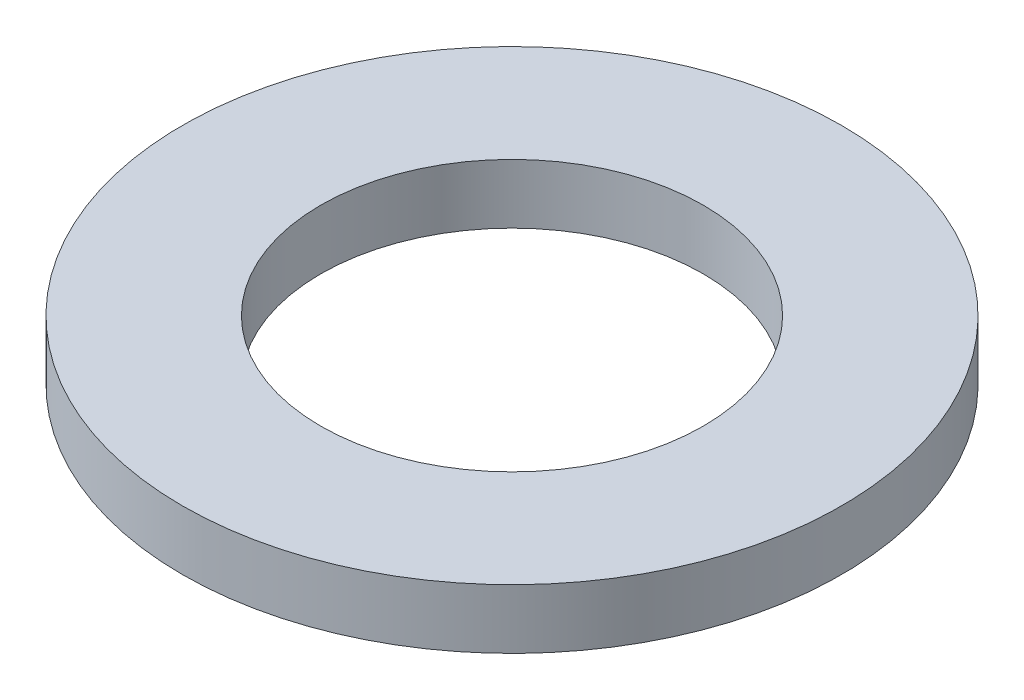
ISO-10303-21;
HEADER;
FILE_DESCRIPTION(('STEP AP214'),'2;1');
FILE_NAME('part.step','',(''),(''),'','','');
FILE_SCHEMA(('AUTOMOTIVE_DESIGN { 1 0 10303 214 1 1 1 1 }'));
ENDSEC;
DATA;
#1=APPLICATION_CONTEXT('core data for automotive mechanical design processes');
#2=APPLICATION_PROTOCOL_DEFINITION('international standard','automotive_design',2000,#1);
#3=PRODUCT_CONTEXT('',#1,'mechanical');
#4=PRODUCT('Part','Part','',(#3));
#5=PRODUCT_RELATED_PRODUCT_CATEGORY('part','',(#4));
#6=PRODUCT_DEFINITION_FORMATION('','',#4);
#7=PRODUCT_DEFINITION_CONTEXT('part definition',#1,'design');
#8=PRODUCT_DEFINITION('design','',#6,#7);
#9=PRODUCT_DEFINITION_SHAPE('','',#8);
#10=(LENGTH_UNIT() NAMED_UNIT(*) SI_UNIT(.MILLI.,.METRE.));
#11=(NAMED_UNIT(*) PLANE_ANGLE_UNIT() SI_UNIT($,.RADIAN.));
#12=(NAMED_UNIT(*) SI_UNIT($,.STERADIAN.) SOLID_ANGLE_UNIT());
#13=UNCERTAINTY_MEASURE_WITH_UNIT(LENGTH_MEASURE(1.E-05),#10,'distance_accuracy_value','');
#14=(GEOMETRIC_REPRESENTATION_CONTEXT(3) GLOBAL_UNCERTAINTY_ASSIGNED_CONTEXT((#13)) GLOBAL_UNIT_ASSIGNED_CONTEXT((#10,
#11,#12)) REPRESENTATION_CONTEXT('',''));
#15=CARTESIAN_POINT('',(0.,0.,0.));
#16=DIRECTION('',(0.,0.,1.));
#17=DIRECTION('',(1.,0.,0.));
#18=AXIS2_PLACEMENT_3D('',#15,#16,#17);
#19=CARTESIAN_POINT('',(0.,14.,0.));
#20=DIRECTION('',(0.,-1.,0.));
#21=DIRECTION('',(0.,0.,-1.));
#22=AXIS2_PLACEMENT_3D('',#19,#20,#21);
#23=CYLINDRICAL_SURFACE('',#22,77.5);
#24=CARTESIAN_POINT('',(0.,14.,0.));
#25=DIRECTION('',(0.,1.,0.));
#26=DIRECTION('',(0.,0.,1.));
#27=AXIS2_PLACEMENT_3D('',#24,#25,#26);
#28=CIRCLE('',#27,77.5);
#29=CARTESIAN_POINT('',(0.,14.,77.5));
#30=VERTEX_POINT('',#29);
#31=EDGE_CURVE('E10',#30,#30,#28,.T.);
#32=ORIENTED_EDGE('',*,*,#31,.F.);
#33=EDGE_LOOP('',(#32));
#34=FACE_BOUND('',#33,.T.);
#35=CARTESIAN_POINT('',(0.,0.,0.));
#36=DIRECTION('',(0.,1.,0.));
#37=DIRECTION('',(0.,0.,1.));
#38=AXIS2_PLACEMENT_3D('',#35,#36,#37);
#39=CIRCLE('',#38,77.5);
#40=CARTESIAN_POINT('',(0.,0.,77.5));
#41=VERTEX_POINT('',#40);
#42=EDGE_CURVE('E37',#41,#41,#39,.T.);
#43=ORIENTED_EDGE('',*,*,#42,.T.);
#44=EDGE_LOOP('',(#43));
#45=FACE_BOUND('',#44,.T.);
#46=ADVANCED_FACE('F40',(#34,#45),#23,.T.);
#47=CARTESIAN_POINT('',(0.,14.,0.));
#48=DIRECTION('',(0.,1.,0.));
#49=DIRECTION('',(0.,0.,1.));
#50=AXIS2_PLACEMENT_3D('',#47,#48,#49);
#51=PLANE('',#50);
#52=CARTESIAN_POINT('',(0.,14.,0.));
#53=DIRECTION('',(0.,1.,0.));
#54=DIRECTION('',(0.,0.,1.));
#55=AXIS2_PLACEMENT_3D('',#52,#53,#54);
#56=CIRCLE('',#55,45.);
#57=CARTESIAN_POINT('',(0.,14.,45.));
#58=VERTEX_POINT('',#57);
#59=EDGE_CURVE('E50',#58,#58,#56,.T.);
#60=ORIENTED_EDGE('',*,*,#59,.F.);
#61=EDGE_LOOP('',(#60));
#62=FACE_BOUND('',#61,.T.);
#63=ORIENTED_EDGE('',*,*,#31,.T.);
#64=EDGE_LOOP('',(#63));
#65=FACE_BOUND('',#64,.T.);
#66=ADVANCED_FACE('F59',(#62,#65),#51,.T.);
#67=CARTESIAN_POINT('',(0.,0.,0.));
#68=DIRECTION('',(0.,1.,0.));
#69=DIRECTION('',(0.,0.,1.));
#70=AXIS2_PLACEMENT_3D('',#67,#68,#69);
#71=PLANE('',#70);
#72=CARTESIAN_POINT('',(0.,0.,0.));
#73=DIRECTION('',(0.,1.,0.));
#74=DIRECTION('',(0.,0.,1.));
#75=AXIS2_PLACEMENT_3D('',#72,#73,#74);
#76=CIRCLE('',#75,45.);
#77=CARTESIAN_POINT('',(0.,0.,45.));
#78=VERTEX_POINT('',#77);
#79=EDGE_CURVE('E47',#78,#78,#76,.T.);
#80=ORIENTED_EDGE('',*,*,#79,.T.);
#81=EDGE_LOOP('',(#80));
#82=FACE_BOUND('',#81,.T.);
#83=ORIENTED_EDGE('',*,*,#42,.F.);
#84=EDGE_LOOP('',(#83));
#85=FACE_BOUND('',#84,.T.);
#86=ADVANCED_FACE('F58',(#82,#85),#71,.F.);
#87=CARTESIAN_POINT('',(0.,14.,0.));
#88=DIRECTION('',(0.,-1.,0.));
#89=DIRECTION('',(0.,0.,-1.));
#90=AXIS2_PLACEMENT_3D('',#87,#88,#89);
#91=CYLINDRICAL_SURFACE('',#90,45.);
#92=ORIENTED_EDGE('',*,*,#59,.T.);
#93=EDGE_LOOP('',(#92));
#94=FACE_BOUND('',#93,.T.);
#95=ORIENTED_EDGE('',*,*,#79,.F.);
#96=EDGE_LOOP('',(#95));
#97=FACE_BOUND('',#96,.T.);
#98=ADVANCED_FACE('F54',(#94,#97),#91,.F.);
#99=CLOSED_SHELL('',(#46,#66,#86,#98));
#100=MANIFOLD_SOLID_BREP('B2',#99);
#101=ADVANCED_BREP_SHAPE_REPRESENTATION('',(#18,#100),#14);
#102=SHAPE_DEFINITION_REPRESENTATION(#9,#101);
ENDSEC;
END-ISO-10303-21;
